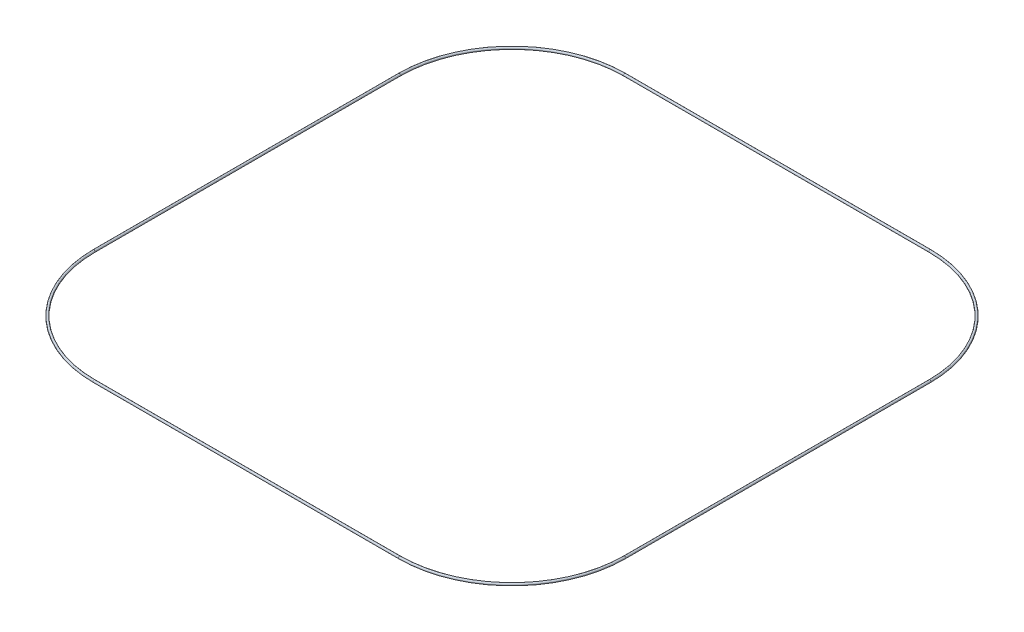
ISO-10303-21;
HEADER;
FILE_DESCRIPTION(('STEP AP214'),'2;1');
FILE_NAME('part.step','',(''),(''),'','','');
FILE_SCHEMA(('AUTOMOTIVE_DESIGN { 1 0 10303 214 1 1 1 1 }'));
ENDSEC;
DATA;
#1=APPLICATION_CONTEXT('core data for automotive mechanical design processes');
#2=APPLICATION_PROTOCOL_DEFINITION('international standard','automotive_design',2000,#1);
#3=PRODUCT_CONTEXT('',#1,'mechanical');
#4=PRODUCT('Part','Part','',(#3));
#5=PRODUCT_RELATED_PRODUCT_CATEGORY('part','',(#4));
#6=PRODUCT_DEFINITION_FORMATION('','',#4);
#7=PRODUCT_DEFINITION_CONTEXT('part definition',#1,'design');
#8=PRODUCT_DEFINITION('design','',#6,#7);
#9=PRODUCT_DEFINITION_SHAPE('','',#8);
#10=(LENGTH_UNIT() NAMED_UNIT(*) SI_UNIT(.MILLI.,.METRE.));
#11=(NAMED_UNIT(*) PLANE_ANGLE_UNIT() SI_UNIT($,.RADIAN.));
#12=(NAMED_UNIT(*) SI_UNIT($,.STERADIAN.) SOLID_ANGLE_UNIT());
#13=UNCERTAINTY_MEASURE_WITH_UNIT(LENGTH_MEASURE(1.E-05),#10,'distance_accuracy_value','');
#14=(GEOMETRIC_REPRESENTATION_CONTEXT(3) GLOBAL_UNCERTAINTY_ASSIGNED_CONTEXT((#13)) GLOBAL_UNIT_ASSIGNED_CONTEXT((#10,
#11,#12)) REPRESENTATION_CONTEXT('',''));
#15=CARTESIAN_POINT('',(0.,0.,0.));
#16=DIRECTION('',(0.,0.,1.));
#17=DIRECTION('',(1.,0.,0.));
#18=AXIS2_PLACEMENT_3D('',#15,#16,#17);
#19=CARTESIAN_POINT('',(157.48,0.,-157.48));
#20=DIRECTION('',(0.,1.,0.));
#21=DIRECTION('',(0.,0.,1.));
#22=AXIS2_PLACEMENT_3D('',#19,#20,#21);
#23=TOROIDAL_SURFACE('',#22,157.48,1.5875);
#24=CARTESIAN_POINT('',(0.,0.,-157.480000000001));
#25=DIRECTION('',(0.,0.,-1.));
#26=DIRECTION('',(-1.,0.,0.));
#27=AXIS2_PLACEMENT_3D('',#24,#25,#26);
#28=CIRCLE('',#27,1.5875);
#29=CARTESIAN_POINT('',(-1.58749999999999,0.,-157.480000000001));
#30=VERTEX_POINT('',#29);
#31=EDGE_CURVE('E60',#30,#30,#28,.T.);
#32=CARTESIAN_POINT('',(157.48,0.,0.));
#33=DIRECTION('',(-1.,0.,0.));
#34=DIRECTION('',(0.,0.,1.));
#35=AXIS2_PLACEMENT_3D('',#32,#33,#34);
#36=CIRCLE('',#35,1.5875);
#37=CARTESIAN_POINT('',(157.48,0.,1.58749999999999));
#38=VERTEX_POINT('',#37);
#39=EDGE_CURVE('E57',#38,#38,#36,.T.);
#40=CARTESIAN_POINT('',(157.48,0.,-157.48));
#41=DIRECTION('',(0.,1.,0.));
#42=DIRECTION('',(0.,0.,1.));
#43=AXIS2_PLACEMENT_3D('',#40,#41,#42);
#44=CIRCLE('',#43,159.0675);
#45=EDGE_CURVE('',#30,#38,#44,.T.);
#46=ORIENTED_EDGE('',*,*,#31,.F.);
#47=ORIENTED_EDGE('',*,*,#39,.T.);
#48=ORIENTED_EDGE('',*,*,#45,.T.);
#49=ORIENTED_EDGE('',*,*,#45,.F.);
#50=EDGE_LOOP('',(#46,#48,#47,#49));
#51=FACE_BOUND('',#50,.T.);
#52=ADVANCED_FACE('F31',(#51),#23,.T.);
#53=CARTESIAN_POINT('',(157.480000000001,0.,0.));
#54=DIRECTION('',(1.,0.,0.));
#55=DIRECTION('',(0.,0.,-1.));
#56=AXIS2_PLACEMENT_3D('',#53,#54,#55);
#57=CYLINDRICAL_SURFACE('',#56,1.5875);
#58=CARTESIAN_POINT('',(584.199999999999,0.,0.));
#59=DIRECTION('',(-1.,0.,0.));
#60=DIRECTION('',(0.,0.,1.));
#61=AXIS2_PLACEMENT_3D('',#58,#59,#60);
#62=CIRCLE('',#61,1.5875);
#63=CARTESIAN_POINT('',(584.199999999999,0.,1.58750000000002));
#64=VERTEX_POINT('',#63);
#65=EDGE_CURVE('E54',#64,#64,#62,.T.);
#66=ORIENTED_EDGE('',*,*,#65,.T.);
#67=EDGE_LOOP('',(#66));
#68=FACE_BOUND('',#67,.T.);
#69=ORIENTED_EDGE('',*,*,#39,.F.);
#70=EDGE_LOOP('',(#69));
#71=FACE_BOUND('',#70,.T.);
#72=ADVANCED_FACE('F67',(#68,#71),#57,.T.);
#73=CARTESIAN_POINT('',(584.2,0.,-157.48));
#74=DIRECTION('',(0.,1.,0.));
#75=DIRECTION('',(0.,0.,1.));
#76=AXIS2_PLACEMENT_3D('',#73,#74,#75);
#77=TOROIDAL_SURFACE('',#76,157.48,1.5875);
#78=CARTESIAN_POINT('',(741.68,0.,-157.480000000001));
#79=DIRECTION('',(0.,0.,1.));
#80=DIRECTION('',(1.,0.,0.));
#81=AXIS2_PLACEMENT_3D('',#78,#79,#80);
#82=CIRCLE('',#81,1.5875);
#83=CARTESIAN_POINT('',(743.2675,0.,-157.480000000001));
#84=VERTEX_POINT('',#83);
#85=EDGE_CURVE('E51',#84,#84,#82,.T.);
#86=CARTESIAN_POINT('',(584.2,0.,-157.48));
#87=DIRECTION('',(0.,1.,0.));
#88=DIRECTION('',(0.,0.,1.));
#89=AXIS2_PLACEMENT_3D('',#86,#87,#88);
#90=CIRCLE('',#89,159.0675);
#91=EDGE_CURVE('',#64,#84,#90,.T.);
#92=ORIENTED_EDGE('',*,*,#65,.F.);
#93=ORIENTED_EDGE('',*,*,#85,.T.);
#94=ORIENTED_EDGE('',*,*,#91,.T.);
#95=ORIENTED_EDGE('',*,*,#91,.F.);
#96=EDGE_LOOP('',(#92,#94,#93,#95));
#97=FACE_BOUND('',#96,.T.);
#98=ADVANCED_FACE('F73',(#97),#77,.T.);
#99=CARTESIAN_POINT('',(741.68,0.,-157.480000000001));
#100=DIRECTION('',(0.,0.,-1.));
#101=DIRECTION('',(-1.,0.,0.));
#102=AXIS2_PLACEMENT_3D('',#99,#100,#101);
#103=CYLINDRICAL_SURFACE('',#102,1.5875);
#104=CARTESIAN_POINT('',(741.68,0.,-584.199999999999));
#105=DIRECTION('',(0.,0.,1.));
#106=DIRECTION('',(1.,0.,0.));
#107=AXIS2_PLACEMENT_3D('',#104,#105,#106);
#108=CIRCLE('',#107,1.5875);
#109=CARTESIAN_POINT('',(743.2675,0.,-584.199999999999));
#110=VERTEX_POINT('',#109);
#111=EDGE_CURVE('E46',#110,#110,#108,.T.);
#112=ORIENTED_EDGE('',*,*,#111,.T.);
#113=EDGE_LOOP('',(#112));
#114=FACE_BOUND('',#113,.T.);
#115=ORIENTED_EDGE('',*,*,#85,.F.);
#116=EDGE_LOOP('',(#115));
#117=FACE_BOUND('',#116,.T.);
#118=ADVANCED_FACE('F79',(#114,#117),#103,.T.);
#119=CARTESIAN_POINT('',(584.2,0.,-584.2));
#120=DIRECTION('',(0.,1.,0.));
#121=DIRECTION('',(0.,0.,1.));
#122=AXIS2_PLACEMENT_3D('',#119,#120,#121);
#123=TOROIDAL_SURFACE('',#122,157.48,1.5875);
#124=CARTESIAN_POINT('',(584.199999999999,0.,-741.68));
#125=DIRECTION('',(1.,0.,0.));
#126=DIRECTION('',(0.,0.,-1.));
#127=AXIS2_PLACEMENT_3D('',#124,#125,#126);
#128=CIRCLE('',#127,1.5875);
#129=CARTESIAN_POINT('',(584.199999999999,0.,-743.2675));
#130=VERTEX_POINT('',#129);
#131=EDGE_CURVE('E42',#130,#130,#128,.T.);
#132=CARTESIAN_POINT('',(584.2,0.,-584.2));
#133=DIRECTION('',(0.,1.,0.));
#134=DIRECTION('',(0.,0.,1.));
#135=AXIS2_PLACEMENT_3D('',#132,#133,#134);
#136=CIRCLE('',#135,159.0675);
#137=EDGE_CURVE('',#110,#130,#136,.T.);
#138=ORIENTED_EDGE('',*,*,#111,.F.);
#139=ORIENTED_EDGE('',*,*,#131,.T.);
#140=ORIENTED_EDGE('',*,*,#137,.T.);
#141=ORIENTED_EDGE('',*,*,#137,.F.);
#142=EDGE_LOOP('',(#138,#140,#139,#141));
#143=FACE_BOUND('',#142,.T.);
#144=ADVANCED_FACE('F83',(#143),#123,.T.);
#145=CARTESIAN_POINT('',(584.199999999999,0.,-741.68));
#146=DIRECTION('',(-1.,0.,0.));
#147=DIRECTION('',(0.,0.,1.));
#148=AXIS2_PLACEMENT_3D('',#145,#146,#147);
#149=CYLINDRICAL_SURFACE('',#148,1.5875);
#150=CARTESIAN_POINT('',(157.480000000001,0.,-741.68));
#151=DIRECTION('',(1.,0.,0.));
#152=DIRECTION('',(0.,0.,-1.));
#153=AXIS2_PLACEMENT_3D('',#150,#151,#152);
#154=CIRCLE('',#153,1.5875);
#155=CARTESIAN_POINT('',(157.480000000001,0.,-743.2675));
#156=VERTEX_POINT('',#155);
#157=EDGE_CURVE('E38',#156,#156,#154,.T.);
#158=ORIENTED_EDGE('',*,*,#157,.T.);
#159=EDGE_LOOP('',(#158));
#160=FACE_BOUND('',#159,.T.);
#161=ORIENTED_EDGE('',*,*,#131,.F.);
#162=EDGE_LOOP('',(#161));
#163=FACE_BOUND('',#162,.T.);
#164=ADVANCED_FACE('F87',(#160,#163),#149,.T.);
#165=CARTESIAN_POINT('',(157.48,0.,-584.2));
#166=DIRECTION('',(0.,1.,0.));
#167=DIRECTION('',(0.,0.,1.));
#168=AXIS2_PLACEMENT_3D('',#165,#166,#167);
#169=TOROIDAL_SURFACE('',#168,157.48,1.5875);
#170=CARTESIAN_POINT('',(2.27595720048159E-12,0.,-584.199999999999));
#171=DIRECTION('',(0.,0.,-1.));
#172=DIRECTION('',(-1.,0.,0.));
#173=AXIS2_PLACEMENT_3D('',#170,#171,#172);
#174=CIRCLE('',#173,1.5875);
#175=CARTESIAN_POINT('',(-1.58749999999994,0.,-584.199999999999));
#176=VERTEX_POINT('',#175);
#177=EDGE_CURVE('E10',#176,#176,#174,.T.);
#178=CARTESIAN_POINT('',(157.48,0.,-584.2));
#179=DIRECTION('',(0.,1.,0.));
#180=DIRECTION('',(0.,0.,1.));
#181=AXIS2_PLACEMENT_3D('',#178,#179,#180);
#182=CIRCLE('',#181,159.0675);
#183=EDGE_CURVE('',#156,#176,#182,.T.);
#184=ORIENTED_EDGE('',*,*,#157,.F.);
#185=ORIENTED_EDGE('',*,*,#177,.T.);
#186=ORIENTED_EDGE('',*,*,#183,.T.);
#187=ORIENTED_EDGE('',*,*,#183,.F.);
#188=EDGE_LOOP('',(#184,#186,#185,#187));
#189=FACE_BOUND('',#188,.T.);
#190=ADVANCED_FACE('F90',(#189),#169,.T.);
#191=CARTESIAN_POINT('',(1.13797860024079E-12,0.,-584.199999999999));
#192=DIRECTION('',(0.,0.,1.));
#193=DIRECTION('',(1.,0.,0.));
#194=AXIS2_PLACEMENT_3D('',#191,#192,#193);
#195=CYLINDRICAL_SURFACE('',#194,1.5875);
#196=ORIENTED_EDGE('',*,*,#31,.T.);
#197=EDGE_LOOP('',(#196));
#198=FACE_BOUND('',#197,.T.);
#199=ORIENTED_EDGE('',*,*,#177,.F.);
#200=EDGE_LOOP('',(#199));
#201=FACE_BOUND('',#200,.T.);
#202=ADVANCED_FACE('F33',(#198,#201),#195,.T.);
#203=CLOSED_SHELL('',(#52,#72,#98,#118,#144,#164,#190,#202));
#204=MANIFOLD_SOLID_BREP('B2',#203);
#205=ADVANCED_BREP_SHAPE_REPRESENTATION('',(#18,#204),#14);
#206=SHAPE_DEFINITION_REPRESENTATION(#9,#205);
ENDSEC;
END-ISO-10303-21;
